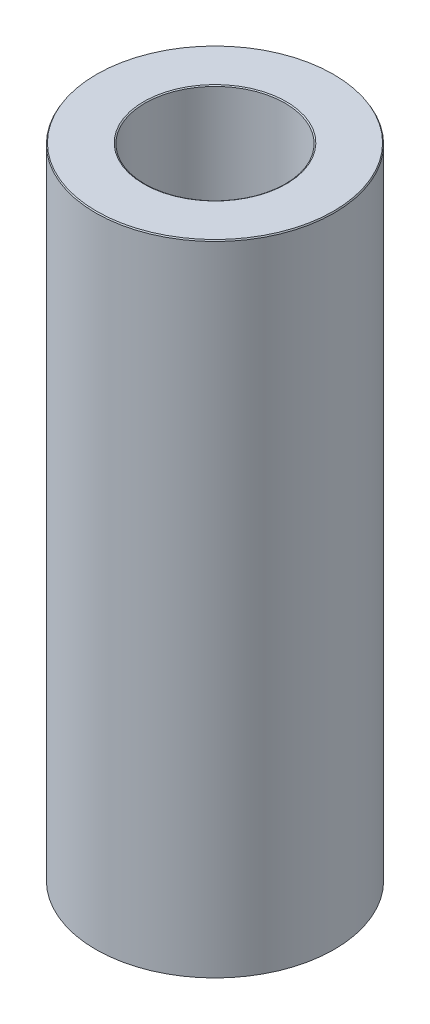
ISO-10303-21;
HEADER;
FILE_DESCRIPTION(('STEP AP214'),'2;1');
FILE_NAME('part.step','',(''),(''),'','','');
FILE_SCHEMA(('AUTOMOTIVE_DESIGN { 1 0 10303 214 1 1 1 1 }'));
ENDSEC;
DATA;
#1=APPLICATION_CONTEXT('core data for automotive mechanical design processes');
#2=APPLICATION_PROTOCOL_DEFINITION('international standard','automotive_design',2000,#1);
#3=PRODUCT_CONTEXT('',#1,'mechanical');
#4=PRODUCT('Part','Part','',(#3));
#5=PRODUCT_RELATED_PRODUCT_CATEGORY('part','',(#4));
#6=PRODUCT_DEFINITION_FORMATION('','',#4);
#7=PRODUCT_DEFINITION_CONTEXT('part definition',#1,'design');
#8=PRODUCT_DEFINITION('design','',#6,#7);
#9=PRODUCT_DEFINITION_SHAPE('','',#8);
#10=(LENGTH_UNIT() NAMED_UNIT(*) SI_UNIT(.MILLI.,.METRE.));
#11=(NAMED_UNIT(*) PLANE_ANGLE_UNIT() SI_UNIT($,.RADIAN.));
#12=(NAMED_UNIT(*) SI_UNIT($,.STERADIAN.) SOLID_ANGLE_UNIT());
#13=UNCERTAINTY_MEASURE_WITH_UNIT(LENGTH_MEASURE(1.E-05),#10,'distance_accuracy_value','');
#14=(GEOMETRIC_REPRESENTATION_CONTEXT(3) GLOBAL_UNCERTAINTY_ASSIGNED_CONTEXT((#13)) GLOBAL_UNIT_ASSIGNED_CONTEXT((#10,
#11,#12)) REPRESENTATION_CONTEXT('',''));
#15=CARTESIAN_POINT('',(0.,0.,0.));
#16=DIRECTION('',(0.,0.,1.));
#17=DIRECTION('',(1.,0.,0.));
#18=AXIS2_PLACEMENT_3D('',#15,#16,#17);
#19=CARTESIAN_POINT('',(0.,174.344077595957,0.));
#20=DIRECTION('',(0.,-1.,0.));
#21=DIRECTION('',(0.,0.,-1.));
#22=AXIS2_PLACEMENT_3D('',#19,#20,#21);
#23=CYLINDRICAL_SURFACE('',#22,32.5);
#24=CARTESIAN_POINT('',(0.,0.199200868838095,0.));
#25=DIRECTION('',(0.,1.,0.));
#26=DIRECTION('',(0.,0.,1.));
#27=AXIS2_PLACEMENT_3D('',#24,#25,#26);
#28=CIRCLE('',#27,32.5);
#29=CARTESIAN_POINT('',(0.,0.199200868838095,32.5));
#30=VERTEX_POINT('',#29);
#31=EDGE_CURVE('E10',#30,#30,#28,.T.);
#32=ORIENTED_EDGE('',*,*,#31,.T.);
#33=EDGE_LOOP('',(#32));
#34=FACE_BOUND('',#33,.T.);
#35=CARTESIAN_POINT('',(0.,174.017666048576,0.));
#36=DIRECTION('',(0.,1.,0.));
#37=DIRECTION('',(0.,0.,1.));
#38=AXIS2_PLACEMENT_3D('',#35,#36,#37);
#39=CIRCLE('',#38,32.5);
#40=CARTESIAN_POINT('',(0.,174.017666048576,32.5));
#41=VERTEX_POINT('',#40);
#42=EDGE_CURVE('E50',#41,#41,#39,.F.);
#43=ORIENTED_EDGE('',*,*,#42,.T.);
#44=EDGE_LOOP('',(#43));
#45=FACE_BOUND('',#44,.T.);
#46=ADVANCED_FACE('F39',(#34,#45),#23,.T.);
#47=CARTESIAN_POINT('',(0.,174.344077595957,0.));
#48=DIRECTION('',(0.,1.,0.));
#49=DIRECTION('',(0.,0.,1.));
#50=AXIS2_PLACEMENT_3D('',#47,#48,#49);
#51=PLANE('',#50);
#52=CARTESIAN_POINT('',(0.,174.344077595957,0.));
#53=DIRECTION('',(0.,1.,0.));
#54=DIRECTION('',(0.,0.,1.));
#55=AXIS2_PLACEMENT_3D('',#52,#53,#54);
#56=CIRCLE('',#55,19.435991251746);
#57=CARTESIAN_POINT('',(0.,174.344077595957,19.435991251746));
#58=VERTEX_POINT('',#57);
#59=EDGE_CURVE('E58',#58,#58,#56,.F.);
#60=ORIENTED_EDGE('',*,*,#59,.T.);
#61=EDGE_LOOP('',(#60));
#62=FACE_BOUND('',#61,.T.);
#63=CARTESIAN_POINT('',(0.,174.344077595957,0.));
#64=DIRECTION('',(0.,1.,0.));
#65=DIRECTION('',(0.,0.,1.));
#66=AXIS2_PLACEMENT_3D('',#63,#64,#65);
#67=CIRCLE('',#66,32.3007991311619);
#68=CARTESIAN_POINT('',(0.,174.344077595957,32.3007991311619));
#69=VERTEX_POINT('',#68);
#70=EDGE_CURVE('E61',#69,#69,#67,.T.);
#71=ORIENTED_EDGE('',*,*,#70,.T.);
#72=EDGE_LOOP('',(#71));
#73=FACE_BOUND('',#72,.T.);
#74=ADVANCED_FACE('F88',(#62,#73),#51,.T.);
#75=CARTESIAN_POINT('',(0.,0.,0.));
#76=DIRECTION('',(0.,1.,0.));
#77=DIRECTION('',(0.,0.,1.));
#78=AXIS2_PLACEMENT_3D('',#75,#76,#77);
#79=PLANE('',#78);
#80=CARTESIAN_POINT('',(0.,0.,0.));
#81=DIRECTION('',(0.,1.,0.));
#82=DIRECTION('',(0.,0.,1.));
#83=AXIS2_PLACEMENT_3D('',#80,#81,#82);
#84=CIRCLE('',#83,19.3087805732038);
#85=CARTESIAN_POINT('',(0.,0.,-19.3087805732038));
#86=VERTEX_POINT('',#85);
#87=EDGE_CURVE('E51',#86,#86,#84,.T.);
#88=ORIENTED_EDGE('',*,*,#87,.T.);
#89=EDGE_LOOP('',(#88));
#90=FACE_BOUND('',#89,.T.);
#91=CARTESIAN_POINT('',(0.,0.,0.));
#92=DIRECTION('',(0.,1.,0.));
#93=DIRECTION('',(0.,0.,1.));
#94=AXIS2_PLACEMENT_3D('',#91,#92,#93);
#95=CIRCLE('',#94,32.1735884526197);
#96=CARTESIAN_POINT('',(0.,0.,32.1735884526197));
#97=VERTEX_POINT('',#96);
#98=EDGE_CURVE('E54',#97,#97,#95,.F.);
#99=ORIENTED_EDGE('',*,*,#98,.T.);
#100=EDGE_LOOP('',(#99));
#101=FACE_BOUND('',#100,.T.);
#102=ADVANCED_FACE('F83',(#90,#101),#79,.F.);
#103=CARTESIAN_POINT('',(0.,174.344077595957,0.));
#104=DIRECTION('',(0.,-1.,0.));
#105=DIRECTION('',(0.,0.,-1.));
#106=AXIS2_PLACEMENT_3D('',#103,#104,#105);
#107=CYLINDRICAL_SURFACE('',#106,19.1095797043657);
#108=CARTESIAN_POINT('',(0.,174.144876727119,0.));
#109=DIRECTION('',(0.,1.,0.));
#110=DIRECTION('',(0.,0.,1.));
#111=AXIS2_PLACEMENT_3D('',#108,#109,#110);
#112=CIRCLE('',#111,19.1095797043657);
#113=CARTESIAN_POINT('',(0.,174.144876727119,-19.1095797043657));
#114=VERTEX_POINT('',#113);
#115=EDGE_CURVE('E67',#114,#114,#112,.T.);
#116=CARTESIAN_POINT('',(0.,0.326411547380334,0.));
#117=DIRECTION('',(0.,1.,0.));
#118=DIRECTION('',(0.,0.,1.));
#119=AXIS2_PLACEMENT_3D('',#116,#117,#118);
#120=CIRCLE('',#119,19.1095797043657);
#121=CARTESIAN_POINT('',(0.,0.326411547380334,-19.1095797043657));
#122=VERTEX_POINT('',#121);
#123=EDGE_CURVE('E69',#122,#122,#120,.F.);
#124=CARTESIAN_POINT('',(0.,174.144876727119,-19.1095797043657));
#125=CARTESIAN_POINT('',(0.,172.33426771483,-19.1095797043657));
#126=CARTESIAN_POINT('',(0.,170.523658702541,-19.1095797043657));
#127=CARTESIAN_POINT('',(0.,166.902440677963,-19.1095797043657));
#128=CARTESIAN_POINT('',(0.,165.091831665674,-19.1095797043657));
#129=CARTESIAN_POINT('',(0.,161.470613641096,-19.1095797043657));
#130=CARTESIAN_POINT('',(0.,159.660004628807,-19.1095797043657));
#131=CARTESIAN_POINT('',(0.,156.038786604229,-19.1095797043657));
#132=CARTESIAN_POINT('',(0.,154.22817759194,-19.1095797043657));
#133=CARTESIAN_POINT('',(0.,150.606959567362,-19.1095797043657));
#134=CARTESIAN_POINT('',(0.,148.796350555074,-19.1095797043657));
#135=CARTESIAN_POINT('',(0.,145.175132530496,-19.1095797043657));
#136=CARTESIAN_POINT('',(0.,143.364523518207,-19.1095797043657));
#137=CARTESIAN_POINT('',(0.,139.743305493629,-19.1095797043657));
#138=CARTESIAN_POINT('',(0.,137.93269648134,-19.1095797043657));
#139=CARTESIAN_POINT('',(0.,134.311478456762,-19.1095797043657));
#140=CARTESIAN_POINT('',(0.,132.500869444473,-19.1095797043657));
#141=CARTESIAN_POINT('',(0.,128.879651419895,-19.1095797043657));
#142=CARTESIAN_POINT('',(0.,127.069042407606,-19.1095797043657));
#143=CARTESIAN_POINT('',(0.,123.447824383028,-19.1095797043657));
#144=CARTESIAN_POINT('',(0.,121.637215370739,-19.1095797043657));
#145=CARTESIAN_POINT('',(0.,118.015997346162,-19.1095797043657));
#146=CARTESIAN_POINT('',(0.,116.205388333873,-19.1095797043657));
#147=CARTESIAN_POINT('',(0.,112.584170309295,-19.1095797043657));
#148=CARTESIAN_POINT('',(0.,110.773561297006,-19.1095797043657));
#149=CARTESIAN_POINT('',(0.,107.152343272428,-19.1095797043657));
#150=CARTESIAN_POINT('',(0.,105.341734260139,-19.1095797043657));
#151=CARTESIAN_POINT('',(0.,101.720516235561,-19.1095797043657));
#152=CARTESIAN_POINT('',(0.,99.9099072232721,-19.1095797043657));
#153=CARTESIAN_POINT('',(0.,96.2886891986942,-19.1095797043657));
#154=CARTESIAN_POINT('',(0.,94.4780801864053,-19.1095797043657));
#155=CARTESIAN_POINT('',(0.,90.8568621618274,-19.1095797043657));
#156=CARTESIAN_POINT('',(0.,89.0462531495384,-19.1095797043657));
#157=CARTESIAN_POINT('',(0.,85.4250351249606,-19.1095797043657));
#158=CARTESIAN_POINT('',(0.,83.6144261126716,-19.1095797043657));
#159=CARTESIAN_POINT('',(0.,79.9932080880937,-19.1095797043657));
#160=CARTESIAN_POINT('',(0.,78.1825990758048,-19.1095797043657));
#161=CARTESIAN_POINT('',(0.,74.5613810512269,-19.1095797043657));
#162=CARTESIAN_POINT('',(0.,72.750772038938,-19.1095797043657));
#163=CARTESIAN_POINT('',(0.,69.1295540143601,-19.1095797043657));
#164=CARTESIAN_POINT('',(0.,67.3189450020712,-19.1095797043657));
#165=CARTESIAN_POINT('',(0.,63.6977269774933,-19.1095797043657));
#166=CARTESIAN_POINT('',(0.,61.8871179652043,-19.1095797043657));
#167=CARTESIAN_POINT('',(0.,58.2658999406264,-19.1095797043657));
#168=CARTESIAN_POINT('',(0.,56.4552909283375,-19.1095797043657));
#169=CARTESIAN_POINT('',(0.,52.8340729037596,-19.1095797043657));
#170=CARTESIAN_POINT('',(0.,51.0234638914707,-19.1095797043657));
#171=CARTESIAN_POINT('',(0.,47.4022458668928,-19.1095797043657));
#172=CARTESIAN_POINT('',(0.,45.5916368546039,-19.1095797043657));
#173=CARTESIAN_POINT('',(0.,41.970418830026,-19.1095797043657));
#174=CARTESIAN_POINT('',(0.,40.159809817737,-19.1095797043657));
#175=CARTESIAN_POINT('',(0.,36.5385917931591,-19.1095797043657));
#176=CARTESIAN_POINT('',(0.,34.7279827808702,-19.1095797043657));
#177=CARTESIAN_POINT('',(0.,31.1067647562923,-19.1095797043657));
#178=CARTESIAN_POINT('',(0.,29.2961557440034,-19.1095797043657));
#179=CARTESIAN_POINT('',(0.,25.6749377194255,-19.1095797043657));
#180=CARTESIAN_POINT('',(0.,23.8643287071365,-19.1095797043657));
#181=CARTESIAN_POINT('',(0.,20.2431106825587,-19.1095797043657));
#182=CARTESIAN_POINT('',(0.,18.4325016702697,-19.1095797043657));
#183=CARTESIAN_POINT('',(0.,14.8112836456919,-19.1095797043657));
#184=CARTESIAN_POINT('',(0.,13.0006746334029,-19.1095797043657));
#185=CARTESIAN_POINT('',(0.,9.37945660882502,-19.1095797043657));
#186=CARTESIAN_POINT('',(0.,7.56884759653607,-19.1095797043657));
#187=CARTESIAN_POINT('',(0.,3.94762957195819,-19.1095797043657));
#188=CARTESIAN_POINT('',(0.,2.13702055966926,-19.1095797043657));
#189=CARTESIAN_POINT('',(0.,0.326411547380334,-19.1095797043657));
#190=B_SPLINE_CURVE_WITH_KNOTS('',3,(#124,#125,#126,#127,#128,#129,#130,#131,#132,#133,#134,
#135,#136,#137,#138,#139,#140,#141,#142,#143,#144,#145,#146,#147,#148,#149,#150,#151,#152,#153,
#154,#155,#156,#157,#158,#159,#160,#161,#162,#163,#164,#165,#166,#167,#168,#169,#170,#171,#172,
#173,#174,#175,#176,#177,#178,#179,#180,#181,#182,#183,#184,#185,#186,#187,#188,#189),
.UNSPECIFIED.,.F.,.F.,(4,2,2,2,2,2,2,2,2,2,2,2,2,2,2,2,2,2,2,2,2,2,2,2,2,2,2,2,2,2,2,2,4),(0.,
5.43182703686684,10.8636540737337,16.2954811106005,21.7273081474673,27.1591351843341,
32.5909622212009,38.0227892580678,43.4546162949346,48.8864433318014,54.3182703686683,
59.7500974055351,65.1819244424019,70.6137514792687,76.0455785161355,81.4774055530024,
86.9092325898692,92.341059626736,97.7728866636028,103.20471370047,108.636540737336,
114.068367774203,119.50019481107,124.932021847937,130.363848884804,135.795675921671,
141.227502958537,146.659329995404,152.091157032271,157.522984069138,162.954811106005,
168.386638142872,173.818465179738),.UNSPECIFIED.);
#191=EDGE_CURVE('BSEAM71',#114,#122,#190,.T.);
#192=ORIENTED_EDGE('',*,*,#115,.T.);
#193=ORIENTED_EDGE('',*,*,#123,.T.);
#194=ORIENTED_EDGE('',*,*,#191,.T.);
#195=ORIENTED_EDGE('',*,*,#191,.F.);
#196=EDGE_LOOP('',(#192,#194,#193,#195));
#197=FACE_BOUND('',#196,.T.);
#198=ADVANCED_FACE('F71',(#197),#107,.F.);
#199=CARTESIAN_POINT('',(0.,174.144876727119,0.));
#200=DIRECTION('',(0.,1.,0.));
#201=DIRECTION('',(0.,0.,1.));
#202=AXIS2_PLACEMENT_3D('',#199,#200,#201);
#203=CONICAL_SURFACE('',#202,19.1095797043657,1.02285577700731);
#204=ORIENTED_EDGE('',*,*,#59,.F.);
#205=EDGE_LOOP('',(#204));
#206=FACE_BOUND('',#205,.T.);
#207=ORIENTED_EDGE('',*,*,#115,.F.);
#208=EDGE_LOOP('',(#207));
#209=FACE_BOUND('',#208,.T.);
#210=ADVANCED_FACE('F77',(#206,#209),#203,.F.);
#211=CARTESIAN_POINT('',(0.,0.,0.));
#212=DIRECTION('',(0.,-1.,0.));
#213=DIRECTION('',(0.,0.,-1.));
#214=AXIS2_PLACEMENT_3D('',#211,#212,#213);
#215=CONICAL_SURFACE('',#214,19.3087805732038,0.547940549787606);
#216=CARTESIAN_POINT('',(0.,0.326411547380334,-19.1095797043657));
#217=CARTESIAN_POINT('',(0.,0.323011427095122,-19.1116547134161));
#218=CARTESIAN_POINT('',(0.,0.31961130680991,-19.1137297224665));
#219=CARTESIAN_POINT('',(0.,0.312811066239487,-19.1178797405673));
#220=CARTESIAN_POINT('',(0.,0.309410945954275,-19.1199547496177));
#221=CARTESIAN_POINT('',(0.,0.302610705383852,-19.1241047677185));
#222=CARTESIAN_POINT('',(0.,0.29921058509864,-19.1261797767689));
#223=CARTESIAN_POINT('',(0.,0.292410344528216,-19.1303297948697));
#224=CARTESIAN_POINT('',(0.,0.289010224243004,-19.1324048039201));
#225=CARTESIAN_POINT('',(0.,0.28220998367258,-19.1365548220209));
#226=CARTESIAN_POINT('',(0.,0.278809863387369,-19.1386298310713));
#227=CARTESIAN_POINT('',(0.,0.272009622816945,-19.1427798491721));
#228=CARTESIAN_POINT('',(0.,0.268609502531733,-19.1448548582225));
#229=CARTESIAN_POINT('',(0.,0.261809261961309,-19.1490048763233));
#230=CARTESIAN_POINT('',(0.,0.258409141676097,-19.1510798853736));
#231=CARTESIAN_POINT('',(0.,0.251608901105674,-19.1552299034744));
#232=CARTESIAN_POINT('',(0.,0.248208780820463,-19.1573049125248));
#233=CARTESIAN_POINT('',(0.,0.241408540250039,-19.1614549306256));
#234=CARTESIAN_POINT('',(0.,0.238008419964827,-19.163529939676));
#235=CARTESIAN_POINT('',(0.,0.231208179394403,-19.1676799577768));
#236=CARTESIAN_POINT('',(0.,0.227808059109191,-19.1697549668272));
#237=CARTESIAN_POINT('',(0.,0.221007818538768,-19.173904984928));
#238=CARTESIAN_POINT('',(0.,0.217607698253556,-19.1759799939784));
#239=CARTESIAN_POINT('',(0.,0.210807457683133,-19.1801300120792));
#240=CARTESIAN_POINT('',(0.,0.207407337397921,-19.1822050211296));
#241=CARTESIAN_POINT('',(0.,0.200607096827497,-19.1863550392304));
#242=CARTESIAN_POINT('',(0.,0.197206976542285,-19.1884300482808));
#243=CARTESIAN_POINT('',(0.,0.190406735971861,-19.1925800663816));
#244=CARTESIAN_POINT('',(0.,0.18700661568665,-19.194655075432));
#245=CARTESIAN_POINT('',(0.,0.180206375116226,-19.1988050935328));
#246=CARTESIAN_POINT('',(0.,0.176806254831014,-19.2008801025832));
#247=CARTESIAN_POINT('',(0.,0.17000601426059,-19.205030120684));
#248=CARTESIAN_POINT('',(0.,0.166605893975379,-19.2071051297344));
#249=CARTESIAN_POINT('',(0.,0.159805653404956,-19.2112551478352));
#250=CARTESIAN_POINT('',(0.,0.156405533119744,-19.2133301568856));
#251=CARTESIAN_POINT('',(0.,0.14960529254932,-19.2174801749863));
#252=CARTESIAN_POINT('',(0.,0.146205172264108,-19.2195551840367));
#253=CARTESIAN_POINT('',(0.,0.139404931693684,-19.2237052021375));
#254=CARTESIAN_POINT('',(0.,0.136004811408473,-19.2257802111879));
#255=CARTESIAN_POINT('',(0.,0.129204570838049,-19.2299302292887));
#256=CARTESIAN_POINT('',(0.,0.125804450552837,-19.2320052383391));
#257=CARTESIAN_POINT('',(0.,0.119004209982413,-19.2361552564399));
#258=CARTESIAN_POINT('',(0.,0.115604089697201,-19.2382302654903));
#259=CARTESIAN_POINT('',(0.,0.108803849126778,-19.2423802835911));
#260=CARTESIAN_POINT('',(0.,0.105403728841566,-19.2444552926415));
#261=CARTESIAN_POINT('',(0.,0.0986034882711429,-19.2486053107423));
#262=CARTESIAN_POINT('',(0.,0.095203367985931,-19.2506803197927));
#263=CARTESIAN_POINT('',(0.,0.088403127415507,-19.2548303378935));
#264=CARTESIAN_POINT('',(0.,0.085003007130295,-19.2569053469439));
#265=CARTESIAN_POINT('',(0.,0.0782027665598715,-19.2610553650447));
#266=CARTESIAN_POINT('',(0.,0.0748026462746601,-19.2631303740951));
#267=CARTESIAN_POINT('',(0.,0.0680024057042366,-19.2672803921959));
#268=CARTESIAN_POINT('',(0.,0.0646022854190246,-19.2693554012463));
#269=CARTESIAN_POINT('',(0.,0.0578020448486007,-19.2735054193471));
#270=CARTESIAN_POINT('',(0.,0.0544019245633887,-19.2755804283975));
#271=CARTESIAN_POINT('',(0.,0.0476016839929652,-19.2797304464983));
#272=CARTESIAN_POINT('',(0.,0.0442015637077538,-19.2818054555487));
#273=CARTESIAN_POINT('',(0.,0.0374013231373303,-19.2859554736495));
#274=CARTESIAN_POINT('',(0.,0.0340012028521183,-19.2880304826998));
#275=CARTESIAN_POINT('',(0.,0.0272009622816943,-19.2921805008006));
#276=CARTESIAN_POINT('',(0.,0.0238008419964824,-19.294255509851));
#277=CARTESIAN_POINT('',(0.,0.0170006014260589,-19.2984055279518));
#278=CARTESIAN_POINT('',(0.,0.0136004811408473,-19.3004805370022));
#279=CARTESIAN_POINT('',(0.,0.00680024057042412,-19.304630555103));
#280=CARTESIAN_POINT('',(0.,0.00340012028521254,-19.3067055641534));
#281=CARTESIAN_POINT('',(0.,0.,-19.3087805732038));
#282=B_SPLINE_CURVE_WITH_KNOTS('',3,(#216,#217,#218,#219,#220,#221,#222,#223,#224,#225,#226,
#227,#228,#229,#230,#231,#232,#233,#234,#235,#236,#237,#238,#239,#240,#241,#242,#243,#244,#245,
#246,#247,#248,#249,#250,#251,#252,#253,#254,#255,#256,#257,#258,#259,#260,#261,#262,#263,#264,
#265,#266,#267,#268,#269,#270,#271,#272,#273,#274,#275,#276,#277,#278,#279,#280,#281),
.UNSPECIFIED.,.F.,.F.,(4,2,2,2,2,2,2,2,2,2,2,2,2,2,2,2,2,2,2,2,2,2,2,2,2,2,2,2,2,2,2,2,4),(0.,
0.0119498252965568,0.0238996505931153,0.0358494758896721,0.0477993011862288,0.0597491264827874,
0.0716989517793441,0.0836487770759009,0.0955986023724594,0.107548427669016,0.119498252965573,
0.131448078262131,0.143397903558688,0.155347728855245,0.167297554151804,0.17924737944836,
0.191197204744919,0.203147030041476,0.215096855338032,0.227046680634591,0.238996505931148,
0.250946331227704,0.262896156524263,0.27484598182082,0.286795807117377,0.298745632413935,
0.310695457710492,0.322645283007049,0.334595108303607,0.346544933600164,0.358494758896721,
0.370444584193279,0.382394409489836),.UNSPECIFIED.);
#283=EDGE_CURVE('BSEAM73',#122,#86,#282,.T.);
#284=ORIENTED_EDGE('',*,*,#123,.F.);
#285=ORIENTED_EDGE('',*,*,#87,.F.);
#286=ORIENTED_EDGE('',*,*,#283,.T.);
#287=ORIENTED_EDGE('',*,*,#283,.F.);
#288=EDGE_LOOP('',(#284,#286,#285,#287));
#289=FACE_BOUND('',#288,.T.);
#290=ADVANCED_FACE('F73',(#289),#215,.F.);
#291=CARTESIAN_POINT('',(0.,0.199200868838095,0.));
#292=DIRECTION('',(0.,1.,0.));
#293=DIRECTION('',(0.,0.,1.));
#294=AXIS2_PLACEMENT_3D('',#291,#292,#293);
#295=CONICAL_SURFACE('',#294,32.5,1.02285577700731);
#296=CARTESIAN_POINT('',(0.,0.,32.1735884526197));
#297=CARTESIAN_POINT('',(0.,0.0020750090503985,32.1769885729049));
#298=CARTESIAN_POINT('',(0.,0.00415001810079473,32.1803886931901));
#299=CARTESIAN_POINT('',(0.,0.0083000362015872,32.1871889337605));
#300=CARTESIAN_POINT('',(0.,0.0103750452519834,32.1905890540457));
#301=CARTESIAN_POINT('',(0.,0.0145250633527774,32.1973892946162));
#302=CARTESIAN_POINT('',(0.,0.0166000724031751,32.2007894149014));
#303=CARTESIAN_POINT('',(0.,0.0207500905039687,32.2075896554718));
#304=CARTESIAN_POINT('',(0.,0.0228250995543645,32.210989775757));
#305=CARTESIAN_POINT('',(0.,0.0269751176551582,32.2177900163274));
#306=CARTESIAN_POINT('',(0.,0.0290501267055561,32.2211901366126));
#307=CARTESIAN_POINT('',(0.,0.0332001448063497,32.2279903771831));
#308=CARTESIAN_POINT('',(0.,0.0352751538567455,32.2313904974683));
#309=CARTESIAN_POINT('',(0.,0.0394251719575392,32.2381907380387));
#310=CARTESIAN_POINT('',(0.,0.041500181007937,32.2415908583239));
#311=CARTESIAN_POINT('',(0.,0.0456501991087307,32.2483910988943));
#312=CARTESIAN_POINT('',(0.,0.0477252081591265,32.2517912191795));
#313=CARTESIAN_POINT('',(0.,0.0518752262599201,32.25859145975));
#314=CARTESIAN_POINT('',(0.,0.053950235310318,32.2619915800352));
#315=CARTESIAN_POINT('',(0.,0.0581002534111116,32.2687918206056));
#316=CARTESIAN_POINT('',(0.,0.0601752624615074,32.2721919408908));
#317=CARTESIAN_POINT('',(0.,0.0643252805623011,32.2789921814612));
#318=CARTESIAN_POINT('',(0.,0.0664002896126989,32.2823923017464));
#319=CARTESIAN_POINT('',(0.,0.0705503077134926,32.2891925423169));
#320=CARTESIAN_POINT('',(0.,0.0726253167638884,32.2925926626021));
#321=CARTESIAN_POINT('',(0.,0.076775334864682,32.2993929031725));
#322=CARTESIAN_POINT('',(0.,0.0788503439150799,32.3027930234577));
#323=CARTESIAN_POINT('',(0.,0.0830003620158735,32.3095932640281));
#324=CARTESIAN_POINT('',(0.,0.0850753710662693,32.3129933843134));
#325=CARTESIAN_POINT('',(0.,0.089225389167063,32.3197936248838));
#326=CARTESIAN_POINT('',(0.,0.0913003982174608,32.323193745169));
#327=CARTESIAN_POINT('',(0.,0.0954504163182545,32.3299939857394));
#328=CARTESIAN_POINT('',(0.,0.0975254253686503,32.3333941060246));
#329=CARTESIAN_POINT('',(0.,0.101675443469444,32.340194346595));
#330=CARTESIAN_POINT('',(0.,0.103750452519842,32.3435944668803));
#331=CARTESIAN_POINT('',(0.,0.107900470620635,32.3503947074507));
#332=CARTESIAN_POINT('',(0.,0.109975479671031,32.3537948277359));
#333=CARTESIAN_POINT('',(0.,0.114125497771825,32.3605950683063));
#334=CARTESIAN_POINT('',(0.,0.116200506822223,32.3639951885915));
#335=CARTESIAN_POINT('',(0.,0.120350524923016,32.370795429162));
#336=CARTESIAN_POINT('',(0.,0.122425533973412,32.3741955494472));
#337=CARTESIAN_POINT('',(0.,0.126575552074206,32.3809957900176));
#338=CARTESIAN_POINT('',(0.,0.128650561124604,32.3843959103028));
#339=CARTESIAN_POINT('',(0.,0.132800579225397,32.3911961508732));
#340=CARTESIAN_POINT('',(0.,0.134875588275793,32.3945962711584));
#341=CARTESIAN_POINT('',(0.,0.139025606376587,32.4013965117289));
#342=CARTESIAN_POINT('',(0.,0.141100615426984,32.4047966320141));
#343=CARTESIAN_POINT('',(0.,0.145250633527779,32.4115968725845));
#344=CARTESIAN_POINT('',(0.,0.147325642578175,32.4149969928697));
#345=CARTESIAN_POINT('',(0.,0.151475660678968,32.4217972334401));
#346=CARTESIAN_POINT('',(0.,0.153550669729365,32.4251973537253));
#347=CARTESIAN_POINT('',(0.,0.157700687830158,32.4319975942958));
#348=CARTESIAN_POINT('',(0.,0.159775696880555,32.435397714581));
#349=CARTESIAN_POINT('',(0.,0.16392571498135,32.4421979551514));
#350=CARTESIAN_POINT('',(0.,0.166000724031747,32.4455980754366));
#351=CARTESIAN_POINT('',(0.,0.17015074213254,32.452398316007));
#352=CARTESIAN_POINT('',(0.,0.172225751182937,32.4557984362922));
#353=CARTESIAN_POINT('',(0.,0.17637576928373,32.4625986768627));
#354=CARTESIAN_POINT('',(0.,0.178450778334127,32.4659987971479));
#355=CARTESIAN_POINT('',(0.,0.18260079643492,32.4727990377183));
#356=CARTESIAN_POINT('',(0.,0.184675805485317,32.4761991580035));
#357=CARTESIAN_POINT('',(0.,0.188825823586111,32.4829993985739));
#358=CARTESIAN_POINT('',(0.,0.190900832636508,32.4863995188592));
#359=CARTESIAN_POINT('',(0.,0.195050850737302,32.4931997594296));
#360=CARTESIAN_POINT('',(0.,0.197125859787699,32.4965998797148));
#361=CARTESIAN_POINT('',(0.,0.199200868838095,32.5));
#362=B_SPLINE_CURVE_WITH_KNOTS('',3,(#296,#297,#298,#299,#300,#301,#302,#303,#304,#305,#306,
#307,#308,#309,#310,#311,#312,#313,#314,#315,#316,#317,#318,#319,#320,#321,#322,#323,#324,#325,
#326,#327,#328,#329,#330,#331,#332,#333,#334,#335,#336,#337,#338,#339,#340,#341,#342,#343,#344,
#345,#346,#347,#348,#349,#350,#351,#352,#353,#354,#355,#356,#357,#358,#359,#360,#361),
.UNSPECIFIED.,.F.,.F.,(4,2,2,2,2,2,2,2,2,2,2,2,2,2,2,2,2,2,2,2,2,2,2,2,2,2,2,2,2,2,2,2,4),(0.,
0.0119498252965542,0.0238996505931144,0.0358494758896686,0.0477993011862288,0.0597491264827831,
0.0716989517793432,0.0836487770758975,0.0955986023724576,0.107548427669012,0.119498252965572,
0.131448078262126,0.143397903558686,0.155347728855241,0.167297554151801,0.179247379448355,
0.191197204744915,0.20314703004147,0.21509685533803,0.227046680634584,0.238996505931144,
0.250946331227698,0.262896156524259,0.274845981820813,0.286795807117373,0.298745632413933,
0.310695457710487,0.322645283007041,0.334595108303602,0.346544933600162,0.358494758896716,
0.37044458419327,0.382394409489831),.UNSPECIFIED.);
#363=EDGE_CURVE('BSEAM76',#97,#30,#362,.T.);
#364=ORIENTED_EDGE('',*,*,#98,.F.);
#365=ORIENTED_EDGE('',*,*,#31,.F.);
#366=ORIENTED_EDGE('',*,*,#363,.T.);
#367=ORIENTED_EDGE('',*,*,#363,.F.);
#368=EDGE_LOOP('',(#364,#366,#365,#367));
#369=FACE_BOUND('',#368,.T.);
#370=ADVANCED_FACE('F76',(#369),#295,.T.);
#371=CARTESIAN_POINT('',(0.,174.344077595957,0.));
#372=DIRECTION('',(0.,-1.,0.));
#373=DIRECTION('',(0.,0.,-1.));
#374=AXIS2_PLACEMENT_3D('',#371,#372,#373);
#375=CONICAL_SURFACE('',#374,32.3007991311619,0.547940549787632);
#376=ORIENTED_EDGE('',*,*,#42,.F.);
#377=EDGE_LOOP('',(#376));
#378=FACE_BOUND('',#377,.T.);
#379=ORIENTED_EDGE('',*,*,#70,.F.);
#380=EDGE_LOOP('',(#379));
#381=FACE_BOUND('',#380,.T.);
#382=ADVANCED_FACE('F45',(#378,#381),#375,.T.);
#383=CLOSED_SHELL('',(#46,#74,#102,#198,#210,#290,#370,#382));
#384=MANIFOLD_SOLID_BREP('B2',#383);
#385=ADVANCED_BREP_SHAPE_REPRESENTATION('',(#18,#384),#14);
#386=SHAPE_DEFINITION_REPRESENTATION(#9,#385);
ENDSEC;
END-ISO-10303-21;
